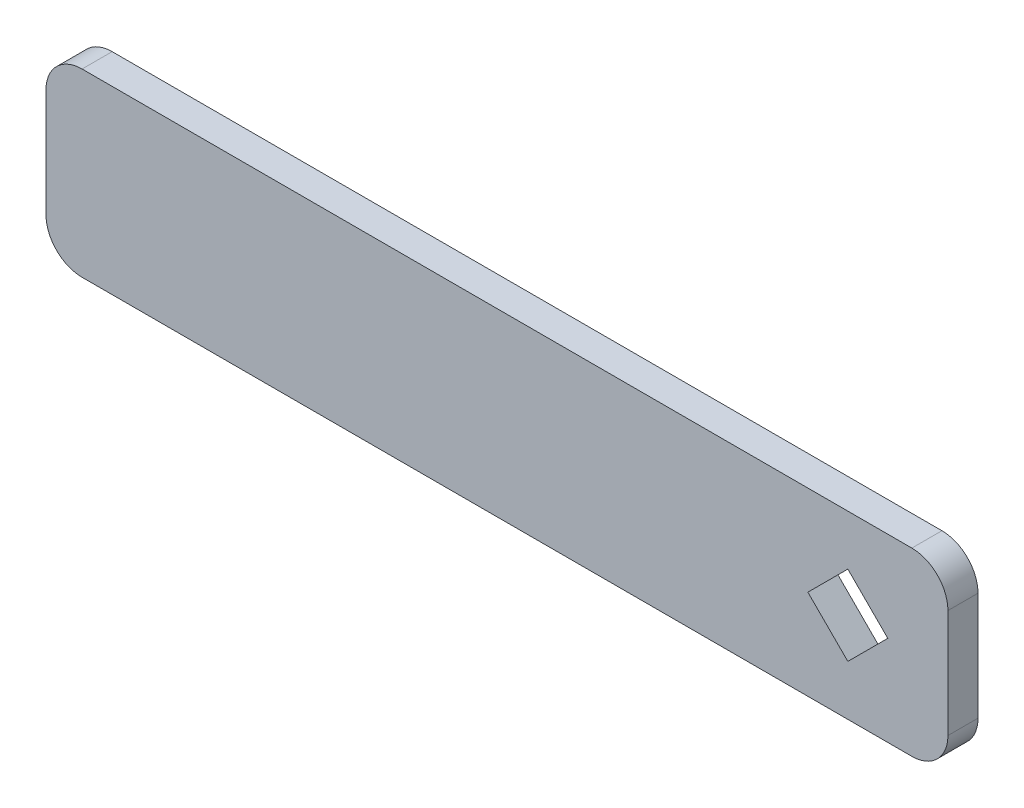
ISO-10303-21;
HEADER;
FILE_DESCRIPTION(('STEP AP214'),'2;1');
FILE_NAME('part.step','',(''),(''),'','','');
FILE_SCHEMA(('AUTOMOTIVE_DESIGN { 1 0 10303 214 1 1 1 1 }'));
ENDSEC;
DATA;
#1=APPLICATION_CONTEXT('core data for automotive mechanical design processes');
#2=APPLICATION_PROTOCOL_DEFINITION('international standard','automotive_design',2000,#1);
#3=PRODUCT_CONTEXT('',#1,'mechanical');
#4=PRODUCT('Part','Part','',(#3));
#5=PRODUCT_RELATED_PRODUCT_CATEGORY('part','',(#4));
#6=PRODUCT_DEFINITION_FORMATION('','',#4);
#7=PRODUCT_DEFINITION_CONTEXT('part definition',#1,'design');
#8=PRODUCT_DEFINITION('design','',#6,#7);
#9=PRODUCT_DEFINITION_SHAPE('','',#8);
#10=(LENGTH_UNIT() NAMED_UNIT(*) SI_UNIT(.MILLI.,.METRE.));
#11=(NAMED_UNIT(*) PLANE_ANGLE_UNIT() SI_UNIT($,.RADIAN.));
#12=(NAMED_UNIT(*) SI_UNIT($,.STERADIAN.) SOLID_ANGLE_UNIT());
#13=UNCERTAINTY_MEASURE_WITH_UNIT(LENGTH_MEASURE(1.E-05),#10,'distance_accuracy_value','');
#14=(GEOMETRIC_REPRESENTATION_CONTEXT(3) GLOBAL_UNCERTAINTY_ASSIGNED_CONTEXT((#13)) GLOBAL_UNIT_ASSIGNED_CONTEXT((#10,
#11,#12)) REPRESENTATION_CONTEXT('',''));
#15=CARTESIAN_POINT('',(0.,0.,0.));
#16=DIRECTION('',(0.,0.,1.));
#17=DIRECTION('',(1.,0.,0.));
#18=AXIS2_PLACEMENT_3D('',#15,#16,#17);
#19=CARTESIAN_POINT('',(0.,0.,5.));
#20=DIRECTION('',(0.,0.,-1.));
#21=DIRECTION('',(-1.,0.,0.));
#22=AXIS2_PLACEMENT_3D('',#19,#20,#21);
#23=PLANE('',#22);
#24=DIRECTION('',(0.,-1.,0.));
#25=VECTOR('',#24,1.);
#26=CARTESIAN_POINT('',(-75.,-15.,5.));
#27=LINE('',#26,#25);
#28=CARTESIAN_POINT('',(-75.,8.99999999999998,5.));
#29=VERTEX_POINT('',#28);
#30=CARTESIAN_POINT('',(-75.,-9.00000000000001,5.));
#31=VERTEX_POINT('',#30);
#32=EDGE_CURVE('E171',#29,#31,#27,.T.);
#33=ORIENTED_EDGE('',*,*,#32,.T.);
#34=CARTESIAN_POINT('',(-69.,-9.00000000000001,5.));
#35=DIRECTION('',(0.,0.,-1.));
#36=DIRECTION('',(-1.,0.,0.));
#37=AXIS2_PLACEMENT_3D('',#34,#35,#36);
#38=CIRCLE('',#37,6.);
#39=CARTESIAN_POINT('',(-69.,-15.,5.));
#40=VERTEX_POINT('',#39);
#41=EDGE_CURVE('E209',#31,#40,#38,.F.);
#42=ORIENTED_EDGE('',*,*,#41,.T.);
#43=DIRECTION('',(1.,0.,0.));
#44=VECTOR('',#43,1.);
#45=CARTESIAN_POINT('',(-75.,-15.,5.));
#46=LINE('',#45,#44);
#47=CARTESIAN_POINT('',(69.,-15.,5.));
#48=VERTEX_POINT('',#47);
#49=EDGE_CURVE('E174',#40,#48,#46,.T.);
#50=ORIENTED_EDGE('',*,*,#49,.T.);
#51=CARTESIAN_POINT('',(69.,-8.99999999999999,5.));
#52=DIRECTION('',(0.,0.,-1.));
#53=DIRECTION('',(-1.,0.,0.));
#54=AXIS2_PLACEMENT_3D('',#51,#52,#53);
#55=CIRCLE('',#54,6.);
#56=CARTESIAN_POINT('',(75.,-8.99999999999999,5.));
#57=VERTEX_POINT('',#56);
#58=EDGE_CURVE('E205',#48,#57,#55,.F.);
#59=ORIENTED_EDGE('',*,*,#58,.T.);
#60=DIRECTION('',(0.,1.,0.));
#61=VECTOR('',#60,1.);
#62=CARTESIAN_POINT('',(75.,-15.,5.));
#63=LINE('',#62,#61);
#64=CARTESIAN_POINT('',(75.,9.00000000000001,5.));
#65=VERTEX_POINT('',#64);
#66=EDGE_CURVE('E166',#57,#65,#63,.T.);
#67=ORIENTED_EDGE('',*,*,#66,.T.);
#68=CARTESIAN_POINT('',(69.,9.00000000000001,5.));
#69=DIRECTION('',(0.,0.,-1.));
#70=DIRECTION('',(-1.,0.,0.));
#71=AXIS2_PLACEMENT_3D('',#68,#69,#70);
#72=CIRCLE('',#71,6.);
#73=CARTESIAN_POINT('',(69.,15.,5.));
#74=VERTEX_POINT('',#73);
#75=EDGE_CURVE('E55',#65,#74,#72,.F.);
#76=ORIENTED_EDGE('',*,*,#75,.T.);
#77=DIRECTION('',(-1.,0.,0.));
#78=VECTOR('',#77,1.);
#79=CARTESIAN_POINT('',(-75.,15.,5.));
#80=LINE('',#79,#78);
#81=CARTESIAN_POINT('',(-69.,15.,5.));
#82=VERTEX_POINT('',#81);
#83=EDGE_CURVE('E168',#74,#82,#80,.T.);
#84=ORIENTED_EDGE('',*,*,#83,.T.);
#85=CARTESIAN_POINT('',(-69.,8.99999999999998,5.));
#86=DIRECTION('',(0.,0.,-1.));
#87=DIRECTION('',(-1.,0.,0.));
#88=AXIS2_PLACEMENT_3D('',#85,#86,#87);
#89=CIRCLE('',#88,6.);
#90=EDGE_CURVE('E207',#82,#29,#89,.F.);
#91=ORIENTED_EDGE('',*,*,#90,.T.);
#92=EDGE_LOOP('',(#33,#42,#50,#59,#67,#76,#84,#91));
#93=FACE_BOUND('',#92,.T.);
#94=DIRECTION('',(-0.707106781186549,-0.707106781186546,0.));
#95=VECTOR('',#94,1.);
#96=CARTESIAN_POINT('',(51.7063925136929,0.,5.));
#97=LINE('',#96,#95);
#98=CARTESIAN_POINT('',(58.3531962568465,6.64680374315355,5.));
#99=VERTEX_POINT('',#98);
#100=CARTESIAN_POINT('',(51.7063925136929,0.,5.));
#101=VERTEX_POINT('',#100);
#102=EDGE_CURVE('E125',#99,#101,#97,.T.);
#103=ORIENTED_EDGE('',*,*,#102,.F.);
#104=DIRECTION('',(-0.707106781186545,0.70710678118655,0.));
#105=VECTOR('',#104,1.);
#106=CARTESIAN_POINT('',(65.,0.,5.));
#107=LINE('',#106,#105);
#108=CARTESIAN_POINT('',(65.,0.,5.));
#109=VERTEX_POINT('',#108);
#110=EDGE_CURVE('E150',#109,#99,#107,.T.);
#111=ORIENTED_EDGE('',*,*,#110,.F.);
#112=DIRECTION('',(0.70710678118655,0.707106781186545,0.));
#113=VECTOR('',#112,1.);
#114=CARTESIAN_POINT('',(58.3531962568465,-6.64680374315354,5.));
#115=LINE('',#114,#113);
#116=CARTESIAN_POINT('',(58.3531962568465,-6.64680374315354,5.));
#117=VERTEX_POINT('',#116);
#118=EDGE_CURVE('E148',#117,#109,#115,.T.);
#119=ORIENTED_EDGE('',*,*,#118,.F.);
#120=DIRECTION('',(0.707106781186546,-0.707106781186549,0.));
#121=VECTOR('',#120,1.);
#122=CARTESIAN_POINT('',(58.3531962568465,-6.64680374315354,5.));
#123=LINE('',#122,#121);
#124=EDGE_CURVE('E135',#101,#117,#123,.T.);
#125=ORIENTED_EDGE('',*,*,#124,.F.);
#126=EDGE_LOOP('',(#103,#111,#119,#125));
#127=FACE_BOUND('',#126,.T.);
#128=ADVANCED_FACE('F33',(#93,#127),#23,.F.);
#129=CARTESIAN_POINT('',(0.,0.,0.));
#130=DIRECTION('',(0.,0.,-1.));
#131=DIRECTION('',(-1.,0.,0.));
#132=AXIS2_PLACEMENT_3D('',#129,#130,#131);
#133=PLANE('',#132);
#134=DIRECTION('',(1.,0.,0.));
#135=VECTOR('',#134,1.);
#136=CARTESIAN_POINT('',(-75.,-15.,0.));
#137=LINE('',#136,#135);
#138=CARTESIAN_POINT('',(-69.,-15.,0.));
#139=VERTEX_POINT('',#138);
#140=CARTESIAN_POINT('',(69.,-15.,0.));
#141=VERTEX_POINT('',#140);
#142=EDGE_CURVE('E169',#139,#141,#137,.T.);
#143=ORIENTED_EDGE('',*,*,#142,.F.);
#144=CARTESIAN_POINT('',(-69.,-9.00000000000001,0.));
#145=DIRECTION('',(0.,0.,-1.));
#146=DIRECTION('',(-1.,0.,0.));
#147=AXIS2_PLACEMENT_3D('',#144,#145,#146);
#148=CIRCLE('',#147,6.);
#149=CARTESIAN_POINT('',(-75.,-9.00000000000001,0.));
#150=VERTEX_POINT('',#149);
#151=EDGE_CURVE('E197',#139,#150,#148,.T.);
#152=ORIENTED_EDGE('',*,*,#151,.T.);
#153=DIRECTION('',(0.,-1.,0.));
#154=VECTOR('',#153,1.);
#155=CARTESIAN_POINT('',(-75.,-15.,0.));
#156=LINE('',#155,#154);
#157=CARTESIAN_POINT('',(-75.,8.99999999999998,0.));
#158=VERTEX_POINT('',#157);
#159=EDGE_CURVE('E182',#158,#150,#156,.T.);
#160=ORIENTED_EDGE('',*,*,#159,.F.);
#161=CARTESIAN_POINT('',(-69.,8.99999999999998,0.));
#162=DIRECTION('',(0.,0.,-1.));
#163=DIRECTION('',(-1.,0.,0.));
#164=AXIS2_PLACEMENT_3D('',#161,#162,#163);
#165=CIRCLE('',#164,6.);
#166=CARTESIAN_POINT('',(-69.,15.,0.));
#167=VERTEX_POINT('',#166);
#168=EDGE_CURVE('E195',#158,#167,#165,.T.);
#169=ORIENTED_EDGE('',*,*,#168,.T.);
#170=DIRECTION('',(-1.,0.,0.));
#171=VECTOR('',#170,1.);
#172=CARTESIAN_POINT('',(-75.,15.,0.));
#173=LINE('',#172,#171);
#174=CARTESIAN_POINT('',(69.,15.,0.));
#175=VERTEX_POINT('',#174);
#176=EDGE_CURVE('E180',#175,#167,#173,.T.);
#177=ORIENTED_EDGE('',*,*,#176,.F.);
#178=CARTESIAN_POINT('',(69.,9.00000000000001,0.));
#179=DIRECTION('',(0.,0.,-1.));
#180=DIRECTION('',(-1.,0.,0.));
#181=AXIS2_PLACEMENT_3D('',#178,#179,#180);
#182=CIRCLE('',#181,6.);
#183=CARTESIAN_POINT('',(75.,9.00000000000001,0.));
#184=VERTEX_POINT('',#183);
#185=EDGE_CURVE('E191',#175,#184,#182,.T.);
#186=ORIENTED_EDGE('',*,*,#185,.T.);
#187=DIRECTION('',(0.,1.,0.));
#188=VECTOR('',#187,1.);
#189=CARTESIAN_POINT('',(75.,-15.,0.));
#190=LINE('',#189,#188);
#191=CARTESIAN_POINT('',(75.,-8.99999999999999,0.));
#192=VERTEX_POINT('',#191);
#193=EDGE_CURVE('E143',#192,#184,#190,.T.);
#194=ORIENTED_EDGE('',*,*,#193,.F.);
#195=CARTESIAN_POINT('',(69.,-8.99999999999999,0.));
#196=DIRECTION('',(0.,0.,-1.));
#197=DIRECTION('',(-1.,0.,0.));
#198=AXIS2_PLACEMENT_3D('',#195,#196,#197);
#199=CIRCLE('',#198,6.);
#200=EDGE_CURVE('E193',#192,#141,#199,.T.);
#201=ORIENTED_EDGE('',*,*,#200,.T.);
#202=EDGE_LOOP('',(#143,#152,#160,#169,#177,#186,#194,#201));
#203=FACE_BOUND('',#202,.T.);
#204=DIRECTION('',(-0.707106781186545,0.70710678118655,0.));
#205=VECTOR('',#204,1.);
#206=CARTESIAN_POINT('',(65.,0.,0.));
#207=LINE('',#206,#205);
#208=CARTESIAN_POINT('',(65.,0.,0.));
#209=VERTEX_POINT('',#208);
#210=CARTESIAN_POINT('',(58.3531962568465,6.64680374315355,0.));
#211=VERTEX_POINT('',#210);
#212=EDGE_CURVE('E136',#209,#211,#207,.T.);
#213=ORIENTED_EDGE('',*,*,#212,.T.);
#214=DIRECTION('',(-0.707106781186549,-0.707106781186546,0.));
#215=VECTOR('',#214,1.);
#216=CARTESIAN_POINT('',(51.7063925136929,0.,0.));
#217=LINE('',#216,#215);
#218=CARTESIAN_POINT('',(51.7063925136929,0.,0.));
#219=VERTEX_POINT('',#218);
#220=EDGE_CURVE('E154',#211,#219,#217,.T.);
#221=ORIENTED_EDGE('',*,*,#220,.T.);
#222=DIRECTION('',(0.707106781186546,-0.707106781186549,0.));
#223=VECTOR('',#222,1.);
#224=CARTESIAN_POINT('',(58.3531962568465,-6.64680374315354,0.));
#225=LINE('',#224,#223);
#226=CARTESIAN_POINT('',(58.3531962568465,-6.64680374315354,0.));
#227=VERTEX_POINT('',#226);
#228=EDGE_CURVE('E142',#219,#227,#225,.T.);
#229=ORIENTED_EDGE('',*,*,#228,.T.);
#230=DIRECTION('',(0.70710678118655,0.707106781186545,0.));
#231=VECTOR('',#230,1.);
#232=CARTESIAN_POINT('',(58.3531962568465,-6.64680374315354,0.));
#233=LINE('',#232,#231);
#234=EDGE_CURVE('E157',#227,#209,#233,.T.);
#235=ORIENTED_EDGE('',*,*,#234,.T.);
#236=EDGE_LOOP('',(#213,#221,#229,#235));
#237=FACE_BOUND('',#236,.T.);
#238=ADVANCED_FACE('F227',(#203,#237),#133,.T.);
#239=CARTESIAN_POINT('',(75.,-15.,5.));
#240=DIRECTION('',(-1.,0.,0.));
#241=DIRECTION('',(0.,0.,1.));
#242=AXIS2_PLACEMENT_3D('',#239,#240,#241);
#243=PLANE('',#242);
#244=ORIENTED_EDGE('',*,*,#66,.F.);
#245=DIRECTION('',(0.,0.,-1.));
#246=VECTOR('',#245,1.);
#247=CARTESIAN_POINT('',(75.,-8.99999999999999,5.));
#248=LINE('',#247,#246);
#249=EDGE_CURVE('E11',#57,#192,#248,.T.);
#250=ORIENTED_EDGE('',*,*,#249,.T.);
#251=ORIENTED_EDGE('',*,*,#193,.T.);
#252=DIRECTION('',(0.,0.,-1.));
#253=VECTOR('',#252,1.);
#254=CARTESIAN_POINT('',(75.,9.00000000000001,5.));
#255=LINE('',#254,#253);
#256=EDGE_CURVE('E41',#184,#65,#255,.F.);
#257=ORIENTED_EDGE('',*,*,#256,.T.);
#258=EDGE_LOOP('',(#244,#250,#251,#257));
#259=FACE_BOUND('',#258,.T.);
#260=ADVANCED_FACE('F217',(#259),#243,.F.);
#261=CARTESIAN_POINT('',(-75.,15.,5.));
#262=DIRECTION('',(0.,-1.,0.));
#263=DIRECTION('',(1.,0.,0.));
#264=AXIS2_PLACEMENT_3D('',#261,#262,#263);
#265=PLANE('',#264);
#266=ORIENTED_EDGE('',*,*,#176,.T.);
#267=DIRECTION('',(0.,0.,-1.));
#268=VECTOR('',#267,1.);
#269=CARTESIAN_POINT('',(-69.,15.,5.));
#270=LINE('',#269,#268);
#271=EDGE_CURVE('E48',#167,#82,#270,.F.);
#272=ORIENTED_EDGE('',*,*,#271,.T.);
#273=ORIENTED_EDGE('',*,*,#83,.F.);
#274=DIRECTION('',(0.,0.,-1.));
#275=VECTOR('',#274,1.);
#276=CARTESIAN_POINT('',(69.,15.,5.));
#277=LINE('',#276,#275);
#278=EDGE_CURVE('E211',#74,#175,#277,.T.);
#279=ORIENTED_EDGE('',*,*,#278,.T.);
#280=EDGE_LOOP('',(#266,#272,#273,#279));
#281=FACE_BOUND('',#280,.T.);
#282=ADVANCED_FACE('F224',(#281),#265,.F.);
#283=CARTESIAN_POINT('',(-75.,-15.,5.));
#284=DIRECTION('',(1.,0.,0.));
#285=DIRECTION('',(0.,0.,-1.));
#286=AXIS2_PLACEMENT_3D('',#283,#284,#285);
#287=PLANE('',#286);
#288=ORIENTED_EDGE('',*,*,#159,.T.);
#289=DIRECTION('',(0.,0.,-1.));
#290=VECTOR('',#289,1.);
#291=CARTESIAN_POINT('',(-75.,-9.00000000000001,5.));
#292=LINE('',#291,#290);
#293=EDGE_CURVE('E202',#150,#31,#292,.F.);
#294=ORIENTED_EDGE('',*,*,#293,.T.);
#295=ORIENTED_EDGE('',*,*,#32,.F.);
#296=DIRECTION('',(0.,0.,-1.));
#297=VECTOR('',#296,1.);
#298=CARTESIAN_POINT('',(-75.,8.99999999999998,5.));
#299=LINE('',#298,#297);
#300=EDGE_CURVE('E199',#29,#158,#299,.T.);
#301=ORIENTED_EDGE('',*,*,#300,.T.);
#302=EDGE_LOOP('',(#288,#294,#295,#301));
#303=FACE_BOUND('',#302,.T.);
#304=ADVANCED_FACE('F236',(#303),#287,.F.);
#305=CARTESIAN_POINT('',(-75.,-15.,5.));
#306=DIRECTION('',(0.,1.,0.));
#307=DIRECTION('',(-1.,0.,0.));
#308=AXIS2_PLACEMENT_3D('',#305,#306,#307);
#309=PLANE('',#308);
#310=ORIENTED_EDGE('',*,*,#49,.F.);
#311=DIRECTION('',(0.,0.,-1.));
#312=VECTOR('',#311,1.);
#313=CARTESIAN_POINT('',(-69.,-15.,5.));
#314=LINE('',#313,#312);
#315=EDGE_CURVE('E188',#40,#139,#314,.T.);
#316=ORIENTED_EDGE('',*,*,#315,.T.);
#317=ORIENTED_EDGE('',*,*,#142,.T.);
#318=DIRECTION('',(0.,0.,-1.));
#319=VECTOR('',#318,1.);
#320=CARTESIAN_POINT('',(69.,-15.,5.));
#321=LINE('',#320,#319);
#322=EDGE_CURVE('E177',#141,#48,#321,.F.);
#323=ORIENTED_EDGE('',*,*,#322,.T.);
#324=EDGE_LOOP('',(#310,#316,#317,#323));
#325=FACE_BOUND('',#324,.T.);
#326=ADVANCED_FACE('F244',(#325),#309,.F.);
#327=CARTESIAN_POINT('',(51.7063925136929,0.,5.));
#328=DIRECTION('',(0.707106781186546,-0.707106781186549,0.));
#329=DIRECTION('',(0.707106781186549,0.707106781186546,0.));
#330=AXIS2_PLACEMENT_3D('',#327,#328,#329);
#331=PLANE('',#330);
#332=ORIENTED_EDGE('',*,*,#220,.F.);
#333=DIRECTION('',(0.,0.,-1.));
#334=VECTOR('',#333,1.);
#335=CARTESIAN_POINT('',(58.3531962568465,6.64680374315355,5.));
#336=LINE('',#335,#334);
#337=EDGE_CURVE('E131',#99,#211,#336,.T.);
#338=ORIENTED_EDGE('',*,*,#337,.F.);
#339=ORIENTED_EDGE('',*,*,#102,.T.);
#340=DIRECTION('',(0.,0.,-1.));
#341=VECTOR('',#340,1.);
#342=CARTESIAN_POINT('',(51.7063925136929,0.,5.));
#343=LINE('',#342,#341);
#344=EDGE_CURVE('E128',#101,#219,#343,.T.);
#345=ORIENTED_EDGE('',*,*,#344,.T.);
#346=EDGE_LOOP('',(#332,#338,#339,#345));
#347=FACE_BOUND('',#346,.T.);
#348=ADVANCED_FACE('F127',(#347),#331,.T.);
#349=CARTESIAN_POINT('',(58.3531962568465,-6.64680374315354,5.));
#350=DIRECTION('',(0.707106781186549,0.707106781186546,0.));
#351=DIRECTION('',(-0.707106781186546,0.707106781186549,0.));
#352=AXIS2_PLACEMENT_3D('',#349,#350,#351);
#353=PLANE('',#352);
#354=ORIENTED_EDGE('',*,*,#228,.F.);
#355=ORIENTED_EDGE('',*,*,#344,.F.);
#356=ORIENTED_EDGE('',*,*,#124,.T.);
#357=DIRECTION('',(0.,0.,-1.));
#358=VECTOR('',#357,1.);
#359=CARTESIAN_POINT('',(58.3531962568465,-6.64680374315354,5.));
#360=LINE('',#359,#358);
#361=EDGE_CURVE('E144',#117,#227,#360,.T.);
#362=ORIENTED_EDGE('',*,*,#361,.T.);
#363=EDGE_LOOP('',(#354,#355,#356,#362));
#364=FACE_BOUND('',#363,.T.);
#365=ADVANCED_FACE('F139',(#364),#353,.T.);
#366=CARTESIAN_POINT('',(58.3531962568465,-6.64680374315354,5.));
#367=DIRECTION('',(-0.707106781186545,0.70710678118655,0.));
#368=DIRECTION('',(-0.70710678118655,-0.707106781186545,0.));
#369=AXIS2_PLACEMENT_3D('',#366,#367,#368);
#370=PLANE('',#369);
#371=ORIENTED_EDGE('',*,*,#234,.F.);
#372=ORIENTED_EDGE('',*,*,#361,.F.);
#373=ORIENTED_EDGE('',*,*,#118,.T.);
#374=DIRECTION('',(0.,0.,-1.));
#375=VECTOR('',#374,1.);
#376=CARTESIAN_POINT('',(65.,0.,5.));
#377=LINE('',#376,#375);
#378=EDGE_CURVE('E163',#109,#209,#377,.T.);
#379=ORIENTED_EDGE('',*,*,#378,.T.);
#380=EDGE_LOOP('',(#371,#372,#373,#379));
#381=FACE_BOUND('',#380,.T.);
#382=ADVANCED_FACE('F277',(#381),#370,.T.);
#383=CARTESIAN_POINT('',(65.,0.,5.));
#384=DIRECTION('',(-0.70710678118655,-0.707106781186545,0.));
#385=DIRECTION('',(0.707106781186545,-0.70710678118655,0.));
#386=AXIS2_PLACEMENT_3D('',#383,#384,#385);
#387=PLANE('',#386);
#388=ORIENTED_EDGE('',*,*,#212,.F.);
#389=ORIENTED_EDGE('',*,*,#378,.F.);
#390=ORIENTED_EDGE('',*,*,#110,.T.);
#391=ORIENTED_EDGE('',*,*,#337,.T.);
#392=EDGE_LOOP('',(#388,#389,#390,#391));
#393=FACE_BOUND('',#392,.T.);
#394=ADVANCED_FACE('F273',(#393),#387,.T.);
#395=CARTESIAN_POINT('',(-69.,-9.00000000000001,5.));
#396=DIRECTION('',(0.,0.,-1.));
#397=DIRECTION('',(-1.,0.,0.));
#398=AXIS2_PLACEMENT_3D('',#395,#396,#397);
#399=CYLINDRICAL_SURFACE('',#398,6.);
#400=ORIENTED_EDGE('',*,*,#41,.F.);
#401=ORIENTED_EDGE('',*,*,#293,.F.);
#402=ORIENTED_EDGE('',*,*,#151,.F.);
#403=ORIENTED_EDGE('',*,*,#315,.F.);
#404=EDGE_LOOP('',(#400,#401,#402,#403));
#405=FACE_BOUND('',#404,.T.);
#406=ADVANCED_FACE('F242',(#405),#399,.T.);
#407=CARTESIAN_POINT('',(-69.,8.99999999999998,5.));
#408=DIRECTION('',(0.,0.,-1.));
#409=DIRECTION('',(-1.,0.,0.));
#410=AXIS2_PLACEMENT_3D('',#407,#408,#409);
#411=CYLINDRICAL_SURFACE('',#410,6.);
#412=ORIENTED_EDGE('',*,*,#90,.F.);
#413=ORIENTED_EDGE('',*,*,#271,.F.);
#414=ORIENTED_EDGE('',*,*,#168,.F.);
#415=ORIENTED_EDGE('',*,*,#300,.F.);
#416=EDGE_LOOP('',(#412,#413,#414,#415));
#417=FACE_BOUND('',#416,.T.);
#418=ADVANCED_FACE('F233',(#417),#411,.T.);
#419=CARTESIAN_POINT('',(69.,-8.99999999999999,5.));
#420=DIRECTION('',(0.,0.,-1.));
#421=DIRECTION('',(-1.,0.,0.));
#422=AXIS2_PLACEMENT_3D('',#419,#420,#421);
#423=CYLINDRICAL_SURFACE('',#422,6.);
#424=ORIENTED_EDGE('',*,*,#58,.F.);
#425=ORIENTED_EDGE('',*,*,#322,.F.);
#426=ORIENTED_EDGE('',*,*,#200,.F.);
#427=ORIENTED_EDGE('',*,*,#249,.F.);
#428=EDGE_LOOP('',(#424,#425,#426,#427));
#429=FACE_BOUND('',#428,.T.);
#430=ADVANCED_FACE('F247',(#429),#423,.T.);
#431=CARTESIAN_POINT('',(69.,9.00000000000001,5.));
#432=DIRECTION('',(0.,0.,-1.));
#433=DIRECTION('',(-1.,0.,0.));
#434=AXIS2_PLACEMENT_3D('',#431,#432,#433);
#435=CYLINDRICAL_SURFACE('',#434,6.);
#436=ORIENTED_EDGE('',*,*,#75,.F.);
#437=ORIENTED_EDGE('',*,*,#256,.F.);
#438=ORIENTED_EDGE('',*,*,#185,.F.);
#439=ORIENTED_EDGE('',*,*,#278,.F.);
#440=EDGE_LOOP('',(#436,#437,#438,#439));
#441=FACE_BOUND('',#440,.T.);
#442=ADVANCED_FACE('F35',(#441),#435,.T.);
#443=CLOSED_SHELL('',(#128,#238,#260,#282,#304,#326,#348,#365,#382,#394,#406,#418,#430,#442));
#444=MANIFOLD_SOLID_BREP('B2',#443);
#445=ADVANCED_BREP_SHAPE_REPRESENTATION('',(#18,#444),#14);
#446=SHAPE_DEFINITION_REPRESENTATION(#9,#445);
ENDSEC;
END-ISO-10303-21;
